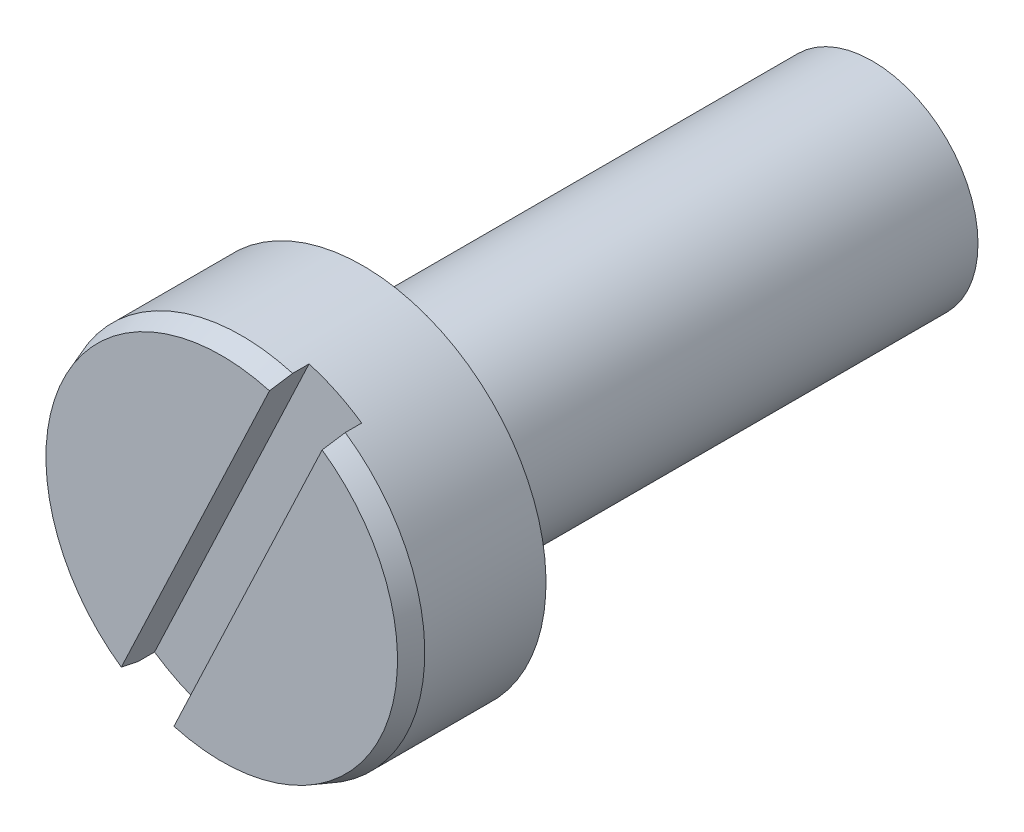
ISO-10303-21;
HEADER;
FILE_DESCRIPTION(('STEP AP214'),'2;1');
FILE_NAME('part.step','',(''),(''),'','','');
FILE_SCHEMA(('AUTOMOTIVE_DESIGN { 1 0 10303 214 1 1 1 1 }'));
ENDSEC;
DATA;
#1=APPLICATION_CONTEXT('core data for automotive mechanical design processes');
#2=APPLICATION_PROTOCOL_DEFINITION('international standard','automotive_design',2000,#1);
#3=PRODUCT_CONTEXT('',#1,'mechanical');
#4=PRODUCT('Part','Part','',(#3));
#5=PRODUCT_RELATED_PRODUCT_CATEGORY('part','',(#4));
#6=PRODUCT_DEFINITION_FORMATION('','',#4);
#7=PRODUCT_DEFINITION_CONTEXT('part definition',#1,'design');
#8=PRODUCT_DEFINITION('design','',#6,#7);
#9=PRODUCT_DEFINITION_SHAPE('','',#8);
#10=(LENGTH_UNIT() NAMED_UNIT(*) SI_UNIT(.MILLI.,.METRE.));
#11=(NAMED_UNIT(*) PLANE_ANGLE_UNIT() SI_UNIT($,.RADIAN.));
#12=(NAMED_UNIT(*) SI_UNIT($,.STERADIAN.) SOLID_ANGLE_UNIT());
#13=UNCERTAINTY_MEASURE_WITH_UNIT(LENGTH_MEASURE(1.E-05),#10,'distance_accuracy_value','');
#14=(GEOMETRIC_REPRESENTATION_CONTEXT(3) GLOBAL_UNCERTAINTY_ASSIGNED_CONTEXT((#13)) GLOBAL_UNIT_ASSIGNED_CONTEXT((#10,
#11,#12)) REPRESENTATION_CONTEXT('',''));
#15=CARTESIAN_POINT('',(0.,0.,0.));
#16=DIRECTION('',(0.,0.,1.));
#17=DIRECTION('',(1.,0.,0.));
#18=AXIS2_PLACEMENT_3D('',#15,#16,#17);
#19=CARTESIAN_POINT('',(0.0121980967922042,-23.3190363147215,19.8000000000003));
#20=DIRECTION('',(0.,0.,-1.));
#21=DIRECTION('',(0.427457329703379,0.904035525453982,0.));
#22=AXIS2_PLACEMENT_3D('',#19,#20,#21);
#23=TOROIDAL_SURFACE('',#22,1.95,0.5);
#24=CARTESIAN_POINT('',(0.0121980967922042,-23.3190363147215,19.8000000000003));
#25=DIRECTION('',(0.,0.,-1.));
#26=DIRECTION('',(0.427457329703379,0.904035525453982,0.));
#27=AXIS2_PLACEMENT_3D('',#24,#25,#26);
#28=CIRCLE('',#27,1.45);
#29=CARTESIAN_POINT('',(0.632011224862104,-22.0081848028132,19.8000000000003));
#30=VERTEX_POINT('',#29);
#31=EDGE_CURVE('E11',#30,#30,#28,.T.);
#32=ORIENTED_EDGE('',*,*,#31,.F.);
#33=EDGE_LOOP('',(#32));
#34=FACE_BOUND('',#33,.T.);
#35=CARTESIAN_POINT('',(0.0121980967922042,-23.3190363147208,20.3000000000003));
#36=DIRECTION('',(0.,0.,1.));
#37=DIRECTION('',(0.427457329703379,0.904035525453982,0.));
#38=AXIS2_PLACEMENT_3D('',#35,#36,#37);
#39=CIRCLE('',#38,1.95);
#40=CARTESIAN_POINT('',(0.845739889713793,-21.5561670400855,20.3000000000003));
#41=VERTEX_POINT('',#40);
#42=EDGE_CURVE('E125',#41,#41,#39,.T.);
#43=ORIENTED_EDGE('',*,*,#42,.F.);
#44=EDGE_LOOP('',(#43));
#45=FACE_BOUND('',#44,.T.);
#46=ADVANCED_FACE('F17',(#34,#45),#23,.F.);
#47=CARTESIAN_POINT('',(0.0121980967922042,-23.3190363147206,13.3000000000003));
#48=DIRECTION('',(0.,0.,1.));
#49=DIRECTION('',(-0.427457329703379,-0.904035525453982,0.));
#50=AXIS2_PLACEMENT_3D('',#47,#48,#49);
#51=CONICAL_SURFACE('',#50,1.175252258055,1.221730476396);
#52=CARTESIAN_POINT('',(0.0121980967922042,-23.3190363147206,13.3000000000003));
#53=DIRECTION('',(0.,0.,-1.));
#54=DIRECTION('',(0.427457329703379,0.904035525453982,0.));
#55=AXIS2_PLACEMENT_3D('',#52,#53,#54);
#56=CIRCLE('',#55,1.175252258055);
#57=CARTESIAN_POINT('',(0.514568288748261,-22.2565665220689,13.3000000000003));
#58=VERTEX_POINT('',#57);
#59=EDGE_CURVE('E110',#58,#58,#56,.T.);
#60=ORIENTED_EDGE('',*,*,#59,.F.);
#61=EDGE_LOOP('',(#60));
#62=FACE_BOUND('',#61,.T.);
#63=CARTESIAN_POINT('',(0.0121980967922042,-23.3190363147215,13.4000000000003));
#64=DIRECTION('',(0.,0.,1.));
#65=DIRECTION('',(0.427457329703379,0.904035525453982,0.));
#66=AXIS2_PLACEMENT_3D('',#63,#64,#65);
#67=CIRCLE('',#66,1.45);
#68=CARTESIAN_POINT('',(0.632011224862104,-22.0081848028132,13.4000000000003));
#69=VERTEX_POINT('',#68);
#70=EDGE_CURVE('E26',#69,#69,#67,.T.);
#71=ORIENTED_EDGE('',*,*,#70,.F.);
#72=EDGE_LOOP('',(#71));
#73=FACE_BOUND('',#72,.T.);
#74=ADVANCED_FACE('F181',(#62,#73),#51,.T.);
#75=CARTESIAN_POINT('',(0.0121980967922042,-23.3190363147208,20.3000000000003));
#76=DIRECTION('',(0.,0.,1.));
#77=DIRECTION('',(-0.427457329703379,-0.904035525453982,0.));
#78=AXIS2_PLACEMENT_3D('',#75,#76,#77);
#79=CONICAL_SURFACE('',#78,2.240252258055,1.221730476396);
#80=CARTESIAN_POINT('',(0.0121980967922042,-23.3190363147208,20.3000000000003));
#81=DIRECTION('',(0.,0.,-1.));
#82=DIRECTION('',(0.427457329703379,0.904035525453982,0.));
#83=AXIS2_PLACEMENT_3D('',#80,#81,#82);
#84=CIRCLE('',#83,2.240252258055);
#85=CARTESIAN_POINT('',(0.96981034488236,-21.2937686874606,20.3000000000003));
#86=VERTEX_POINT('',#85);
#87=EDGE_CURVE('E121',#86,#86,#84,.T.);
#88=ORIENTED_EDGE('',*,*,#87,.F.);
#89=EDGE_LOOP('',(#88));
#90=FACE_BOUND('',#89,.T.);
#91=CARTESIAN_POINT('',(0.0121980967922042,-23.3190363147206,20.4000000000003));
#92=DIRECTION('',(0.,0.,1.));
#93=DIRECTION('',(0.427457329703379,0.904035525453982,0.));
#94=AXIS2_PLACEMENT_3D('',#91,#92,#93);
#95=CIRCLE('',#94,2.515);
#96=CARTESIAN_POINT('',(1.0872532809962,-21.0453869682039,20.4000000000003));
#97=VERTEX_POINT('',#96);
#98=EDGE_CURVE('E68',#97,#97,#95,.T.);
#99=ORIENTED_EDGE('',*,*,#98,.F.);
#100=EDGE_LOOP('',(#99));
#101=FACE_BOUND('',#100,.T.);
#102=ADVANCED_FACE('F186',(#90,#101),#79,.T.);
#103=CARTESIAN_POINT('',(0.0121980967922042,-23.3190363147206,13.3000000000003));
#104=DIRECTION('',(0.,0.,-1.));
#105=DIRECTION('',(0.427457329703379,0.904035525453982,0.));
#106=AXIS2_PLACEMENT_3D('',#103,#104,#105);
#107=CYLINDRICAL_SURFACE('',#106,1.45);
#108=ORIENTED_EDGE('',*,*,#31,.T.);
#109=EDGE_LOOP('',(#108));
#110=FACE_BOUND('',#109,.T.);
#111=ORIENTED_EDGE('',*,*,#70,.T.);
#112=EDGE_LOOP('',(#111));
#113=FACE_BOUND('',#112,.T.);
#114=ADVANCED_FACE('F174',(#110,#113),#107,.T.);
#115=CARTESIAN_POINT('',(0.0121980967922042,-23.3190363147206,13.3000000000003));
#116=DIRECTION('',(0.,0.,-1.));
#117=DIRECTION('',(0.427457329703379,0.904035525453982,0.));
#118=AXIS2_PLACEMENT_3D('',#115,#116,#117);
#119=CYLINDRICAL_SURFACE('',#118,2.515);
#120=CARTESIAN_POINT('',(0.0121980967922042,-23.3190363147212,21.8400000000003));
#121=DIRECTION('',(0.,0.,-1.));
#122=DIRECTION('',(-0.427457329703369,-0.904035525453986,0.));
#123=AXIS2_PLACEMENT_3D('',#120,#121,#122);
#124=CIRCLE('',#123,2.515);
#125=CARTESIAN_POINT('',(-0.687558733750815,-25.734727805394,21.8400000000003));
#126=VERTEX_POINT('',#125);
#127=CARTESIAN_POINT('',(-1.4107871541148,-25.3927619416313,21.8400000000003));
#128=VERTEX_POINT('',#127);
#129=EDGE_CURVE('E145',#126,#128,#124,.T.);
#130=ORIENTED_EDGE('',*,*,#129,.T.);
#131=DIRECTION('',(0.,0.,-1.));
#132=VECTOR('',#131,1.);
#133=CARTESIAN_POINT('',(-1.4107871541138,-25.3927619416312,13.3000000000003));
#134=LINE('',#133,#132);
#135=CARTESIAN_POINT('',(-1.4107871541148,-25.3927619416313,22.0652522580553));
#136=VERTEX_POINT('',#135);
#137=EDGE_CURVE('E64',#136,#128,#134,.T.);
#138=ORIENTED_EDGE('',*,*,#137,.F.);
#139=CARTESIAN_POINT('',(0.0121980967922042,-23.3190363147211,22.0652522580553));
#140=DIRECTION('',(0.,0.,-1.));
#141=DIRECTION('',(-0.427457329703379,-0.904035525453982,0.));
#142=AXIS2_PLACEMENT_3D('',#139,#140,#141);
#143=CIRCLE('',#142,2.515);
#144=CARTESIAN_POINT('',(0.711954927335196,-20.9033448240482,22.0652522580553));
#145=VERTEX_POINT('',#144);
#146=EDGE_CURVE('E53',#136,#145,#143,.T.);
#147=ORIENTED_EDGE('',*,*,#146,.T.);
#148=DIRECTION('',(0.,0.,1.));
#149=VECTOR('',#148,1.);
#150=CARTESIAN_POINT('',(0.711954927335196,-20.9033448240476,13.3000000000003));
#151=LINE('',#150,#149);
#152=CARTESIAN_POINT('',(0.711954927335196,-20.9033448240483,21.8400000000003));
#153=VERTEX_POINT('',#152);
#154=EDGE_CURVE('E61',#153,#145,#151,.T.);
#155=ORIENTED_EDGE('',*,*,#154,.F.);
#156=CARTESIAN_POINT('',(0.0121980967922042,-23.3190363147212,21.8400000000003));
#157=DIRECTION('',(0.,0.,-1.));
#158=DIRECTION('',(-0.427457329703379,-0.904035525453982,0.));
#159=AXIS2_PLACEMENT_3D('',#156,#157,#158);
#160=CIRCLE('',#159,2.515);
#161=CARTESIAN_POINT('',(1.43518334769818,-21.2453106878113,21.8400000000003));
#162=VERTEX_POINT('',#161);
#163=EDGE_CURVE('E93',#153,#162,#160,.T.);
#164=ORIENTED_EDGE('',*,*,#163,.T.);
#165=DIRECTION('',(0.,0.,-1.));
#166=VECTOR('',#165,1.);
#167=CARTESIAN_POINT('',(1.43518334769918,-21.2453106878106,13.3000000000003));
#168=LINE('',#167,#166);
#169=CARTESIAN_POINT('',(1.43518334769818,-21.2453106878112,22.0652522580553));
#170=VERTEX_POINT('',#169);
#171=EDGE_CURVE('E96',#170,#162,#168,.T.);
#172=ORIENTED_EDGE('',*,*,#171,.F.);
#173=CARTESIAN_POINT('',(-0.687558733750815,-25.7347278053939,22.0652522580553));
#174=VERTEX_POINT('',#173);
#175=EDGE_CURVE('E106',#170,#174,#143,.T.);
#176=ORIENTED_EDGE('',*,*,#175,.T.);
#177=DIRECTION('',(0.,0.,1.));
#178=VECTOR('',#177,1.);
#179=CARTESIAN_POINT('',(-0.687558733750815,-25.7347278053939,13.3000000000003));
#180=LINE('',#179,#178);
#181=EDGE_CURVE('E103',#126,#174,#180,.T.);
#182=ORIENTED_EDGE('',*,*,#181,.F.);
#183=EDGE_LOOP('',(#130,#138,#147,#155,#164,#172,#176,#182));
#184=FACE_BOUND('',#183,.T.);
#185=ORIENTED_EDGE('',*,*,#98,.T.);
#186=EDGE_LOOP('',(#185));
#187=FACE_BOUND('',#186,.T.);
#188=ADVANCED_FACE('F56',(#184,#187),#119,.T.);
#189=CARTESIAN_POINT('',(0.0121980967922042,-23.3190363147215,22.3400000000003));
#190=DIRECTION('',(0.,0.,1.));
#191=DIRECTION('',(-0.427457329703379,-0.904035525453982,0.));
#192=AXIS2_PLACEMENT_3D('',#189,#190,#191);
#193=PLANE('',#192);
#194=DIRECTION('',(-0.427457329703379,-0.904035525453982,0.));
#195=VECTOR('',#194,1.);
#196=CARTESIAN_POINT('',(-1.64726577789281,-25.8928939128254,22.3400000000003));
#197=LINE('',#196,#195);
#198=CARTESIAN_POINT('',(0.668634789125183,-20.9949631943226,22.3400000000004));
#199=VERTEX_POINT('',#198);
#200=CARTESIAN_POINT('',(-1.36746701590482,-25.3011435713568,22.3400000000003));
#201=VERTEX_POINT('',#200);
#202=EDGE_CURVE('E76',#199,#201,#197,.T.);
#203=ORIENTED_EDGE('',*,*,#202,.F.);
#204=CARTESIAN_POINT('',(0.0121980967922042,-23.3190363147215,22.3400000000003));
#205=DIRECTION('',(0.,0.,1.));
#206=DIRECTION('',(-0.427457329703379,-0.904035525453982,0.));
#207=AXIS2_PLACEMENT_3D('',#204,#205,#206);
#208=CIRCLE('',#207,2.415);
#209=EDGE_CURVE('E36',#199,#201,#208,.T.);
#210=ORIENTED_EDGE('',*,*,#209,.T.);
#211=EDGE_LOOP('',(#203,#210));
#212=FACE_BOUND('',#211,.T.);
#213=ADVANCED_FACE('F163',(#212),#193,.T.);
#214=CARTESIAN_POINT('',(0.0121980967922042,-23.3190363147211,22.0652522580553));
#215=DIRECTION('',(0.,0.,-1.));
#216=DIRECTION('',(0.427457329703379,0.904035525453982,0.));
#217=AXIS2_PLACEMENT_3D('',#214,#215,#216);
#218=CONICAL_SURFACE('',#217,2.515,0.349065850399);
#219=CARTESIAN_POINT('',(327.257732713187,669.71291857427,-261.393080578831));
#220=DIRECTION('',(0.904035525452299,-0.427457329706938,1.46077674032882E-12));
#221=DIRECTION('',(-0.401017918661995,-0.848118442749434,0.346236531839547));
#222=AXIS2_PLACEMENT_3D('',#219,#220,#221);
#223=CIRCLE('',#222,819.477595478914);
#224=EDGE_CURVE('E153',#201,#136,#223,.T.);
#225=ORIENTED_EDGE('',*,*,#224,.F.);
#226=ORIENTED_EDGE('',*,*,#209,.F.);
#227=CARTESIAN_POINT('',(-327.956562303542,-716.009019772195,-261.3930783065));
#228=DIRECTION('',(0.904035525453982,-0.427457329703379,0.));
#229=DIRECTION('',(0.401070781773213,0.848230243697522,0.345901260021795));
#230=AXIS2_PLACEMENT_3D('',#227,#228,#229);
#231=CIRCLE('',#230,819.477588912782);
#232=EDGE_CURVE('E71',#145,#199,#231,.T.);
#233=ORIENTED_EDGE('',*,*,#232,.F.);
#234=ORIENTED_EDGE('',*,*,#146,.F.);
#235=EDGE_LOOP('',(#225,#226,#233,#234));
#236=FACE_BOUND('',#235,.T.);
#237=ADVANCED_FACE('F72',(#236),#218,.T.);
#238=DIRECTION('',(0.427457329703379,0.904035525453982,0.));
#239=VECTOR('',#238,1.);
#240=CARTESIAN_POINT('',(-0.924037357529828,-26.2348597765882,22.3400000000002));
#241=LINE('',#240,#239);
#242=CARTESIAN_POINT('',(-0.644238595541802,-25.6431094351194,22.3400000000003));
#243=VERTEX_POINT('',#242);
#244=CARTESIAN_POINT('',(1.3918632094882,-21.3369290580856,22.3400000000004));
#245=VERTEX_POINT('',#244);
#246=EDGE_CURVE('E246',#243,#245,#241,.T.);
#247=ORIENTED_EDGE('',*,*,#246,.F.);
#248=EDGE_CURVE('E111',#243,#245,#208,.T.);
#249=ORIENTED_EDGE('',*,*,#248,.T.);
#250=EDGE_LOOP('',(#247,#249));
#251=FACE_BOUND('',#250,.T.);
#252=ADVANCED_FACE('F166',(#251),#193,.T.);
#253=CARTESIAN_POINT('',(2.2858474433092,-24.3940914989248,20.3000000000004));
#254=DIRECTION('',(0.,0.,-1.));
#255=DIRECTION('',(0.427457329703379,0.904035525453982,0.));
#256=AXIS2_PLACEMENT_3D('',#253,#254,#255);
#257=PLANE('',#256);
#258=ORIENTED_EDGE('',*,*,#42,.T.);
#259=EDGE_LOOP('',(#258));
#260=FACE_BOUND('',#259,.T.);
#261=ORIENTED_EDGE('',*,*,#87,.T.);
#262=EDGE_LOOP('',(#261));
#263=FACE_BOUND('',#262,.T.);
#264=ADVANCED_FACE('F178',(#260,#263),#257,.T.);
#265=CARTESIAN_POINT('',(1.32304960870019,-23.9388494427906,13.3000000000003));
#266=DIRECTION('',(0.,0.,-1.));
#267=DIRECTION('',(0.427457329703379,0.904035525453982,0.));
#268=AXIS2_PLACEMENT_3D('',#265,#266,#267);
#269=PLANE('',#268);
#270=ORIENTED_EDGE('',*,*,#59,.T.);
#271=EDGE_LOOP('',(#270));
#272=FACE_BOUND('',#271,.T.);
#273=ADVANCED_FACE('F208',(#272),#269,.T.);
#274=CARTESIAN_POINT('',(-327.233336519595,-716.350991203707,-261.393080578849));
#275=DIRECTION('',(-0.904035525452299,0.427457329706938,1.44341947337369E-12));
#276=DIRECTION('',(0.401017918661986,0.848118442749428,0.346236531839572));
#277=AXIS2_PLACEMENT_3D('',#274,#275,#276);
#278=CIRCLE('',#277,819.477595478914);
#279=EDGE_CURVE('E86',#245,#170,#278,.T.);
#280=ORIENTED_EDGE('',*,*,#279,.F.);
#281=ORIENTED_EDGE('',*,*,#248,.F.);
#282=CARTESIAN_POINT('',(327.980958497133,669.370947142758,-261.39307830648));
#283=DIRECTION('',(-0.904035525453982,0.427457329703379,0.));
#284=DIRECTION('',(-0.401070781773222,-0.848230243697527,0.345901260021773));
#285=AXIS2_PLACEMENT_3D('',#282,#283,#284);
#286=CIRCLE('',#285,819.477588912782);
#287=EDGE_CURVE('E115',#174,#243,#286,.T.);
#288=ORIENTED_EDGE('',*,*,#287,.F.);
#289=ORIENTED_EDGE('',*,*,#175,.F.);
#290=EDGE_LOOP('',(#280,#281,#288,#289));
#291=FACE_BOUND('',#290,.T.);
#292=ADVANCED_FACE('F173',(#291),#218,.T.);
#293=CARTESIAN_POINT('',(-1.64726577789281,-25.8928939128254,21.8400000000003));
#294=DIRECTION('',(-0.904035525453982,0.427457329703379,0.));
#295=DIRECTION('',(-0.427457329703379,-0.904035525453982,0.));
#296=AXIS2_PLACEMENT_3D('',#293,#294,#295);
#297=PLANE('',#296);
#298=ORIENTED_EDGE('',*,*,#137,.T.);
#299=DIRECTION('',(-0.427457329703379,-0.904035525453982,0.));
#300=VECTOR('',#299,1.);
#301=CARTESIAN_POINT('',(-1.64726577789281,-25.8928939128254,21.8400000000003));
#302=LINE('',#301,#300);
#303=EDGE_CURVE('E81',#153,#128,#302,.T.);
#304=ORIENTED_EDGE('',*,*,#303,.F.);
#305=ORIENTED_EDGE('',*,*,#154,.T.);
#306=ORIENTED_EDGE('',*,*,#232,.T.);
#307=ORIENTED_EDGE('',*,*,#202,.T.);
#308=ORIENTED_EDGE('',*,*,#224,.T.);
#309=EDGE_LOOP('',(#298,#304,#305,#306,#307,#308));
#310=FACE_BOUND('',#309,.T.);
#311=ADVANCED_FACE('F79',(#310),#297,.F.);
#312=CARTESIAN_POINT('',(-0.924037357529828,-26.2348597765882,21.8400000000002));
#313=DIRECTION('',(0.904035525453982,-0.427457329703379,0.));
#314=DIRECTION('',(0.427457329703379,0.904035525453982,0.));
#315=AXIS2_PLACEMENT_3D('',#312,#313,#314);
#316=PLANE('',#315);
#317=ORIENTED_EDGE('',*,*,#171,.T.);
#318=DIRECTION('',(0.427457329703379,0.904035525453982,0.));
#319=VECTOR('',#318,1.);
#320=CARTESIAN_POINT('',(-0.924037357529828,-26.2348597765882,21.8400000000002));
#321=LINE('',#320,#319);
#322=EDGE_CURVE('E97',#126,#162,#321,.T.);
#323=ORIENTED_EDGE('',*,*,#322,.F.);
#324=ORIENTED_EDGE('',*,*,#181,.T.);
#325=ORIENTED_EDGE('',*,*,#287,.T.);
#326=ORIENTED_EDGE('',*,*,#246,.T.);
#327=ORIENTED_EDGE('',*,*,#279,.T.);
#328=EDGE_LOOP('',(#317,#323,#324,#325,#326,#327));
#329=FACE_BOUND('',#328,.T.);
#330=ADVANCED_FACE('F217',(#329),#316,.F.);
#331=CARTESIAN_POINT('',(0.0121980967922042,-23.3190363147212,21.8400000000003));
#332=DIRECTION('',(0.,0.,1.));
#333=DIRECTION('',(-0.427457329703379,-0.904035525453982,0.));
#334=AXIS2_PLACEMENT_3D('',#331,#332,#333);
#335=PLANE('',#334);
#336=ORIENTED_EDGE('',*,*,#303,.T.);
#337=ORIENTED_EDGE('',*,*,#129,.F.);
#338=ORIENTED_EDGE('',*,*,#322,.T.);
#339=ORIENTED_EDGE('',*,*,#163,.F.);
#340=EDGE_LOOP('',(#336,#337,#338,#339));
#341=FACE_BOUND('',#340,.T.);
#342=ADVANCED_FACE('F220',(#341),#335,.T.);
#343=CLOSED_SHELL('',(#46,#74,#102,#114,#188,#213,#237,#252,#264,#273,#292,#311,#330,#342));
#344=MANIFOLD_SOLID_BREP('B1',#343);
#345=ADVANCED_BREP_SHAPE_REPRESENTATION('',(#18,#344),#14);
#346=SHAPE_DEFINITION_REPRESENTATION(#9,#345);
ENDSEC;
END-ISO-10303-21;
